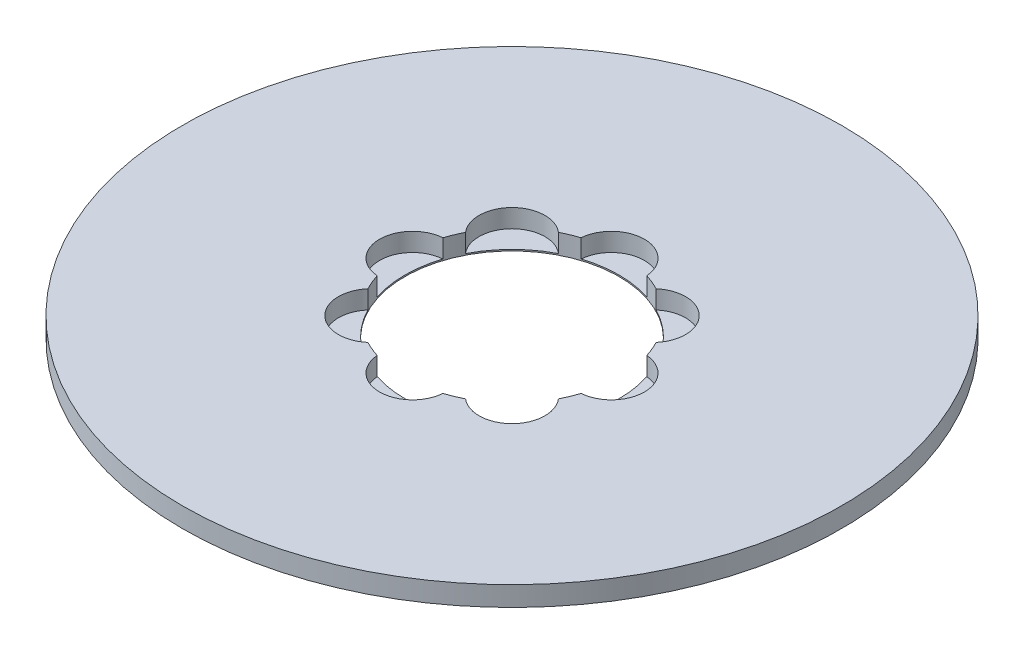
ISO-10303-21;
HEADER;
FILE_DESCRIPTION(('STEP AP214'),'2;1');
FILE_NAME('part.step','',(''),(''),'','','');
FILE_SCHEMA(('AUTOMOTIVE_DESIGN { 1 0 10303 214 1 1 1 1 }'));
ENDSEC;
DATA;
#1=APPLICATION_CONTEXT('core data for automotive mechanical design processes');
#2=APPLICATION_PROTOCOL_DEFINITION('international standard','automotive_design',2000,#1);
#3=PRODUCT_CONTEXT('',#1,'mechanical');
#4=PRODUCT('Part','Part','',(#3));
#5=PRODUCT_RELATED_PRODUCT_CATEGORY('part','',(#4));
#6=PRODUCT_DEFINITION_FORMATION('','',#4);
#7=PRODUCT_DEFINITION_CONTEXT('part definition',#1,'design');
#8=PRODUCT_DEFINITION('design','',#6,#7);
#9=PRODUCT_DEFINITION_SHAPE('','',#8);
#10=(LENGTH_UNIT() NAMED_UNIT(*) SI_UNIT(.MILLI.,.METRE.));
#11=(NAMED_UNIT(*) PLANE_ANGLE_UNIT() SI_UNIT($,.RADIAN.));
#12=(NAMED_UNIT(*) SI_UNIT($,.STERADIAN.) SOLID_ANGLE_UNIT());
#13=UNCERTAINTY_MEASURE_WITH_UNIT(LENGTH_MEASURE(1.E-05),#10,'distance_accuracy_value','');
#14=(GEOMETRIC_REPRESENTATION_CONTEXT(3) GLOBAL_UNCERTAINTY_ASSIGNED_CONTEXT((#13)) GLOBAL_UNIT_ASSIGNED_CONTEXT((#10,
#11,#12)) REPRESENTATION_CONTEXT('',''));
#15=CARTESIAN_POINT('',(0.,0.,0.));
#16=DIRECTION('',(0.,0.,1.));
#17=DIRECTION('',(1.,0.,0.));
#18=AXIS2_PLACEMENT_3D('',#15,#16,#17);
#19=CARTESIAN_POINT('',(0.,6.,0.));
#20=DIRECTION('',(0.,-1.,0.));
#21=DIRECTION('',(0.,0.,-1.));
#22=AXIS2_PLACEMENT_3D('',#19,#20,#21);
#23=CYLINDRICAL_SURFACE('',#22,100.);
#24=CARTESIAN_POINT('',(0.,6.,0.));
#25=DIRECTION('',(0.,1.,0.));
#26=DIRECTION('',(0.,0.,1.));
#27=AXIS2_PLACEMENT_3D('',#24,#25,#26);
#28=CIRCLE('',#27,100.);
#29=CARTESIAN_POINT('',(0.,6.,100.));
#30=VERTEX_POINT('',#29);
#31=EDGE_CURVE('E183',#30,#30,#28,.T.);
#32=ORIENTED_EDGE('',*,*,#31,.F.);
#33=EDGE_LOOP('',(#32));
#34=FACE_BOUND('',#33,.T.);
#35=CARTESIAN_POINT('',(0.,0.,0.));
#36=DIRECTION('',(0.,1.,0.));
#37=DIRECTION('',(0.,0.,1.));
#38=AXIS2_PLACEMENT_3D('',#35,#36,#37);
#39=CIRCLE('',#38,100.);
#40=CARTESIAN_POINT('',(0.,0.,100.));
#41=VERTEX_POINT('',#40);
#42=EDGE_CURVE('E182',#41,#41,#39,.T.);
#43=ORIENTED_EDGE('',*,*,#42,.T.);
#44=EDGE_LOOP('',(#43));
#45=FACE_BOUND('',#44,.T.);
#46=ADVANCED_FACE('F39',(#34,#45),#23,.T.);
#47=CARTESIAN_POINT('',(0.,6.,0.));
#48=DIRECTION('',(0.,1.,0.));
#49=DIRECTION('',(0.,0.,1.));
#50=AXIS2_PLACEMENT_3D('',#47,#48,#49);
#51=PLANE('',#50);
#52=CARTESIAN_POINT('',(1.05336279165295E-13,6.,30.169509426677));
#53=DIRECTION('',(0.,1.,0.));
#54=DIRECTION('',(1.,0.,0.));
#55=AXIS2_PLACEMENT_3D('',#52,#53,#54);
#56=CIRCLE('',#55,10.);
#57=CARTESIAN_POINT('',(-9.97083380300948,6.,30.9327087930036));
#58=VERTEX_POINT('',#57);
#59=CARTESIAN_POINT('',(9.9708338030097,6.,30.9327087930036));
#60=VERTEX_POINT('',#59);
#61=EDGE_CURVE('E256',#58,#60,#56,.T.);
#62=ORIENTED_EDGE('',*,*,#61,.F.);
#63=CARTESIAN_POINT('',(0.,6.,0.));
#64=DIRECTION('',(0.,1.,0.));
#65=DIRECTION('',(0.,0.,1.));
#66=AXIS2_PLACEMENT_3D('',#63,#64,#65);
#67=CIRCLE('',#66,32.5);
#68=CARTESIAN_POINT('',(-14.8222839518094,6.,28.9231723441937));
#69=VERTEX_POINT('',#68);
#70=EDGE_CURVE('E175',#69,#58,#67,.T.);
#71=ORIENTED_EDGE('',*,*,#70,.F.);
#72=CARTESIAN_POINT('',(-21.3330647006747,6.,21.3330647006748));
#73=DIRECTION('',(0.,1.,0.));
#74=DIRECTION('',(0.707106781186549,0.,0.707106781186546));
#75=AXIS2_PLACEMENT_3D('',#72,#73,#74);
#76=CIRCLE('',#75,10.);
#77=CARTESIAN_POINT('',(-28.9231723441937,6.,14.8222839518095));
#78=VERTEX_POINT('',#77);
#79=EDGE_CURVE('E152',#78,#69,#76,.T.);
#80=ORIENTED_EDGE('',*,*,#79,.F.);
#81=CARTESIAN_POINT('',(-30.9327087930036,6.,9.97083380300959));
#82=VERTEX_POINT('',#81);
#83=EDGE_CURVE('E168',#82,#78,#67,.T.);
#84=ORIENTED_EDGE('',*,*,#83,.F.);
#85=CARTESIAN_POINT('',(-30.169509426677,6.,0.));
#86=DIRECTION('',(0.,1.,0.));
#87=DIRECTION('',(0.,0.,1.));
#88=AXIS2_PLACEMENT_3D('',#85,#86,#87);
#89=CIRCLE('',#88,10.);
#90=CARTESIAN_POINT('',(-30.9327087930036,6.,-9.97083380300959));
#91=VERTEX_POINT('',#90);
#92=EDGE_CURVE('E205',#91,#82,#89,.T.);
#93=ORIENTED_EDGE('',*,*,#92,.F.);
#94=CARTESIAN_POINT('',(-28.9231723441939,6.,-14.8222839518091));
#95=VERTEX_POINT('',#94);
#96=EDGE_CURVE('E181',#95,#91,#67,.T.);
#97=ORIENTED_EDGE('',*,*,#96,.F.);
#98=CARTESIAN_POINT('',(-21.333064700675,6.,-21.3330647006745));
#99=DIRECTION('',(0.,1.,0.));
#100=DIRECTION('',(-0.707106781186539,0.,0.707106781186556));
#101=AXIS2_PLACEMENT_3D('',#98,#99,#100);
#102=CIRCLE('',#101,10.);
#103=CARTESIAN_POINT('',(-14.8222839518098,6.,-28.9231723441935));
#104=VERTEX_POINT('',#103);
#105=EDGE_CURVE('E453',#104,#95,#102,.T.);
#106=ORIENTED_EDGE('',*,*,#105,.F.);
#107=CARTESIAN_POINT('',(-9.97083380300991,6.,-30.9327087930035));
#108=VERTEX_POINT('',#107);
#109=EDGE_CURVE('E189',#108,#104,#67,.T.);
#110=ORIENTED_EDGE('',*,*,#109,.F.);
#111=CARTESIAN_POINT('',(-3.16008837495884E-13,6.,-30.169509426677));
#112=DIRECTION('',(0.,1.,0.));
#113=DIRECTION('',(-1.,0.,0.));
#114=AXIS2_PLACEMENT_3D('',#111,#112,#113);
#115=CIRCLE('',#114,10.);
#116=CARTESIAN_POINT('',(9.97083380300927,6.,-30.9327087930037));
#117=VERTEX_POINT('',#116);
#118=EDGE_CURVE('E462',#117,#108,#115,.T.);
#119=ORIENTED_EDGE('',*,*,#118,.F.);
#120=CARTESIAN_POINT('',(14.8222839518092,6.,-28.9231723441938));
#121=VERTEX_POINT('',#120);
#122=EDGE_CURVE('E197',#121,#117,#67,.T.);
#123=ORIENTED_EDGE('',*,*,#122,.F.);
#124=CARTESIAN_POINT('',(21.3330647006746,6.,-21.3330647006749));
#125=DIRECTION('',(0.,1.,0.));
#126=DIRECTION('',(-0.707106781186554,0.,-0.707106781186541));
#127=AXIS2_PLACEMENT_3D('',#124,#125,#126);
#128=CIRCLE('',#127,10.);
#129=CARTESIAN_POINT('',(28.9231723441936,6.,-14.8222839518097));
#130=VERTEX_POINT('',#129);
#131=EDGE_CURVE('E470',#130,#121,#128,.T.);
#132=ORIENTED_EDGE('',*,*,#131,.F.);
#133=CARTESIAN_POINT('',(30.9327087930036,6.,-9.97083380300959));
#134=VERTEX_POINT('',#133);
#135=EDGE_CURVE('E489',#134,#130,#67,.T.);
#136=ORIENTED_EDGE('',*,*,#135,.F.);
#137=CARTESIAN_POINT('',(30.169509426677,6.,0.));
#138=DIRECTION('',(0.,1.,0.));
#139=DIRECTION('',(0.,0.,-1.));
#140=AXIS2_PLACEMENT_3D('',#137,#138,#139);
#141=CIRCLE('',#140,10.);
#142=CARTESIAN_POINT('',(30.9327087930036,6.,9.97083380300959));
#143=VERTEX_POINT('',#142);
#144=EDGE_CURVE('E476',#143,#134,#141,.T.);
#145=ORIENTED_EDGE('',*,*,#144,.F.);
#146=CARTESIAN_POINT('',(28.9231723441938,6.,14.8222839518093));
#147=VERTEX_POINT('',#146);
#148=EDGE_CURVE('E491',#147,#143,#67,.T.);
#149=ORIENTED_EDGE('',*,*,#148,.F.);
#150=CARTESIAN_POINT('',(21.3330647006749,6.,21.3330647006746));
#151=DIRECTION('',(0.,1.,0.));
#152=DIRECTION('',(0.707106781186544,0.,-0.707106781186551));
#153=AXIS2_PLACEMENT_3D('',#150,#151,#152);
#154=CIRCLE('',#153,10.);
#155=CARTESIAN_POINT('',(14.8222839518096,6.,28.9231723441936));
#156=VERTEX_POINT('',#155);
#157=EDGE_CURVE('E475',#156,#147,#154,.T.);
#158=ORIENTED_EDGE('',*,*,#157,.F.);
#159=EDGE_CURVE('E190',#60,#156,#67,.T.);
#160=ORIENTED_EDGE('',*,*,#159,.F.);
#161=EDGE_LOOP('',(#62,#71,#80,#84,#93,#97,#106,#110,#119,#123,#132,#136,#145,#149,#158,#160));
#162=FACE_BOUND('',#161,.T.);
#163=ORIENTED_EDGE('',*,*,#31,.T.);
#164=EDGE_LOOP('',(#163));
#165=FACE_BOUND('',#164,.T.);
#166=ADVANCED_FACE('F170',(#162,#165),#51,.T.);
#167=CARTESIAN_POINT('',(0.,0.,0.));
#168=DIRECTION('',(0.,1.,0.));
#169=DIRECTION('',(0.,0.,1.));
#170=AXIS2_PLACEMENT_3D('',#167,#168,#169);
#171=PLANE('',#170);
#172=CARTESIAN_POINT('',(0.,0.,0.));
#173=DIRECTION('',(0.,1.,0.));
#174=DIRECTION('',(0.,0.,1.));
#175=AXIS2_PLACEMENT_3D('',#172,#173,#174);
#176=CIRCLE('',#175,32.5);
#177=CARTESIAN_POINT('',(0.,0.,32.5));
#178=VERTEX_POINT('',#177);
#179=EDGE_CURVE('E191',#178,#178,#176,.T.);
#180=ORIENTED_EDGE('',*,*,#179,.T.);
#181=EDGE_LOOP('',(#180));
#182=FACE_BOUND('',#181,.T.);
#183=ORIENTED_EDGE('',*,*,#42,.F.);
#184=EDGE_LOOP('',(#183));
#185=FACE_BOUND('',#184,.T.);
#186=ADVANCED_FACE('F277',(#182,#185),#171,.F.);
#187=CARTESIAN_POINT('',(0.,6.,0.));
#188=DIRECTION('',(0.,-1.,0.));
#189=DIRECTION('',(0.,0.,-1.));
#190=AXIS2_PLACEMENT_3D('',#187,#188,#189);
#191=CYLINDRICAL_SURFACE('',#190,32.5);
#192=DIRECTION('',(0.,1.,0.));
#193=VECTOR('',#192,1.);
#194=CARTESIAN_POINT('',(-9.97083380300948,3.21015580010637,30.9327087930036));
#195=LINE('',#194,#193);
#196=CARTESIAN_POINT('',(-9.97083380300948,0.420311600212744,30.9327087930036));
#197=VERTEX_POINT('',#196);
#198=EDGE_CURVE('E11',#197,#58,#195,.T.);
#199=ORIENTED_EDGE('',*,*,#198,.F.);
#200=CARTESIAN_POINT('',(0.,0.420311600212744,0.));
#201=DIRECTION('',(0.,1.,0.));
#202=DIRECTION('',(0.,0.,1.));
#203=AXIS2_PLACEMENT_3D('',#200,#201,#202);
#204=CIRCLE('',#203,32.5);
#205=CARTESIAN_POINT('',(9.9708338030097,0.420311600212744,30.9327087930036));
#206=VERTEX_POINT('',#205);
#207=EDGE_CURVE('E251',#197,#206,#204,.T.);
#208=ORIENTED_EDGE('',*,*,#207,.T.);
#209=DIRECTION('',(0.,1.,0.));
#210=VECTOR('',#209,1.);
#211=CARTESIAN_POINT('',(9.9708338030097,3.21015580010637,30.9327087930035));
#212=LINE('',#211,#210);
#213=EDGE_CURVE('E46',#60,#206,#212,.F.);
#214=ORIENTED_EDGE('',*,*,#213,.F.);
#215=ORIENTED_EDGE('',*,*,#159,.T.);
#216=DIRECTION('',(0.,1.,0.));
#217=VECTOR('',#216,1.);
#218=CARTESIAN_POINT('',(14.8222839518096,3.21015580010637,28.9231723441936));
#219=LINE('',#218,#217);
#220=CARTESIAN_POINT('',(14.8222839518096,0.420311600212744,28.9231723441936));
#221=VERTEX_POINT('',#220);
#222=EDGE_CURVE('E253',#221,#156,#219,.T.);
#223=ORIENTED_EDGE('',*,*,#222,.F.);
#224=CARTESIAN_POINT('',(0.,0.420311600212744,0.));
#225=DIRECTION('',(0.,1.,0.));
#226=DIRECTION('',(0.,0.,1.));
#227=AXIS2_PLACEMENT_3D('',#224,#225,#226);
#228=CIRCLE('',#227,32.5);
#229=CARTESIAN_POINT('',(28.9231723441938,0.420311600212744,14.8222839518093));
#230=VERTEX_POINT('',#229);
#231=EDGE_CURVE('E246',#221,#230,#228,.T.);
#232=ORIENTED_EDGE('',*,*,#231,.T.);
#233=DIRECTION('',(0.,1.,0.));
#234=VECTOR('',#233,1.);
#235=CARTESIAN_POINT('',(28.9231723441938,3.21015580010637,14.8222839518093));
#236=LINE('',#235,#234);
#237=EDGE_CURVE('E248',#147,#230,#236,.F.);
#238=ORIENTED_EDGE('',*,*,#237,.F.);
#239=ORIENTED_EDGE('',*,*,#148,.T.);
#240=DIRECTION('',(0.,1.,0.));
#241=VECTOR('',#240,1.);
#242=CARTESIAN_POINT('',(30.9327087930036,3.21015580010637,9.97083380300959));
#243=LINE('',#242,#241);
#244=CARTESIAN_POINT('',(30.9327087930036,0.420311600212744,9.97083380300959));
#245=VERTEX_POINT('',#244);
#246=EDGE_CURVE('E243',#245,#143,#243,.T.);
#247=ORIENTED_EDGE('',*,*,#246,.F.);
#248=CARTESIAN_POINT('',(0.,0.420311600212744,0.));
#249=DIRECTION('',(0.,1.,0.));
#250=DIRECTION('',(0.,0.,1.));
#251=AXIS2_PLACEMENT_3D('',#248,#249,#250);
#252=CIRCLE('',#251,32.5);
#253=CARTESIAN_POINT('',(30.9327087930036,0.420311600212744,-9.97083380300959));
#254=VERTEX_POINT('',#253);
#255=EDGE_CURVE('E236',#245,#254,#252,.T.);
#256=ORIENTED_EDGE('',*,*,#255,.T.);
#257=DIRECTION('',(0.,1.,0.));
#258=VECTOR('',#257,1.);
#259=CARTESIAN_POINT('',(30.9327087930036,3.21015580010637,-9.97083380300959));
#260=LINE('',#259,#258);
#261=EDGE_CURVE('E241',#134,#254,#260,.F.);
#262=ORIENTED_EDGE('',*,*,#261,.F.);
#263=ORIENTED_EDGE('',*,*,#135,.T.);
#264=DIRECTION('',(0.,1.,0.));
#265=VECTOR('',#264,1.);
#266=CARTESIAN_POINT('',(28.9231723441936,3.21015580010637,-14.8222839518097));
#267=LINE('',#266,#265);
#268=CARTESIAN_POINT('',(28.9231723441936,0.420311600212744,-14.8222839518097));
#269=VERTEX_POINT('',#268);
#270=EDGE_CURVE('E237',#269,#130,#267,.T.);
#271=ORIENTED_EDGE('',*,*,#270,.F.);
#272=CARTESIAN_POINT('',(0.,0.420311600212744,0.));
#273=DIRECTION('',(0.,1.,0.));
#274=DIRECTION('',(0.,0.,1.));
#275=AXIS2_PLACEMENT_3D('',#272,#273,#274);
#276=CIRCLE('',#275,32.5);
#277=CARTESIAN_POINT('',(14.8222839518092,0.420311600212744,-28.9231723441938));
#278=VERTEX_POINT('',#277);
#279=EDGE_CURVE('E229',#269,#278,#276,.T.);
#280=ORIENTED_EDGE('',*,*,#279,.T.);
#281=DIRECTION('',(0.,1.,0.));
#282=VECTOR('',#281,1.);
#283=CARTESIAN_POINT('',(14.8222839518092,3.21015580010637,-28.9231723441938));
#284=LINE('',#283,#282);
#285=EDGE_CURVE('E232',#121,#278,#284,.F.);
#286=ORIENTED_EDGE('',*,*,#285,.F.);
#287=ORIENTED_EDGE('',*,*,#122,.T.);
#288=DIRECTION('',(0.,1.,0.));
#289=VECTOR('',#288,1.);
#290=CARTESIAN_POINT('',(9.97083380300927,3.21015580010637,-30.9327087930037));
#291=LINE('',#290,#289);
#292=CARTESIAN_POINT('',(9.97083380300927,0.420311600212744,-30.9327087930037));
#293=VERTEX_POINT('',#292);
#294=EDGE_CURVE('E227',#293,#117,#291,.T.);
#295=ORIENTED_EDGE('',*,*,#294,.F.);
#296=CARTESIAN_POINT('',(0.,0.420311600212744,0.));
#297=DIRECTION('',(0.,1.,0.));
#298=DIRECTION('',(0.,0.,1.));
#299=AXIS2_PLACEMENT_3D('',#296,#297,#298);
#300=CIRCLE('',#299,32.5);
#301=CARTESIAN_POINT('',(-9.97083380300991,0.420311600212744,-30.9327087930035));
#302=VERTEX_POINT('',#301);
#303=EDGE_CURVE('E225',#293,#302,#300,.T.);
#304=ORIENTED_EDGE('',*,*,#303,.T.);
#305=DIRECTION('',(0.,1.,0.));
#306=VECTOR('',#305,1.);
#307=CARTESIAN_POINT('',(-9.97083380300991,3.21015580010637,-30.9327087930035));
#308=LINE('',#307,#306);
#309=EDGE_CURVE('E223',#108,#302,#308,.F.);
#310=ORIENTED_EDGE('',*,*,#309,.F.);
#311=ORIENTED_EDGE('',*,*,#109,.T.);
#312=DIRECTION('',(0.,1.,0.));
#313=VECTOR('',#312,1.);
#314=CARTESIAN_POINT('',(-14.8222839518098,3.21015580010637,-28.9231723441935));
#315=LINE('',#314,#313);
#316=CARTESIAN_POINT('',(-14.8222839518098,0.420311600212744,-28.9231723441935));
#317=VERTEX_POINT('',#316);
#318=EDGE_CURVE('E219',#317,#104,#315,.T.);
#319=ORIENTED_EDGE('',*,*,#318,.F.);
#320=CARTESIAN_POINT('',(0.,0.420311600212744,0.));
#321=DIRECTION('',(0.,1.,0.));
#322=DIRECTION('',(0.,0.,1.));
#323=AXIS2_PLACEMENT_3D('',#320,#321,#322);
#324=CIRCLE('',#323,32.5);
#325=CARTESIAN_POINT('',(-28.9231723441939,0.420311600212744,-14.8222839518091));
#326=VERTEX_POINT('',#325);
#327=EDGE_CURVE('E159',#317,#326,#324,.T.);
#328=ORIENTED_EDGE('',*,*,#327,.T.);
#329=DIRECTION('',(0.,1.,0.));
#330=VECTOR('',#329,1.);
#331=CARTESIAN_POINT('',(-28.9231723441939,3.21015580010637,-14.8222839518091));
#332=LINE('',#331,#330);
#333=EDGE_CURVE('E220',#95,#326,#332,.F.);
#334=ORIENTED_EDGE('',*,*,#333,.F.);
#335=ORIENTED_EDGE('',*,*,#96,.T.);
#336=DIRECTION('',(0.,1.,0.));
#337=VECTOR('',#336,1.);
#338=CARTESIAN_POINT('',(-30.9327087930036,3.21015580010637,-9.97083380300959));
#339=LINE('',#338,#337);
#340=CARTESIAN_POINT('',(-30.9327087930036,0.420311600212744,-9.97083380300959));
#341=VERTEX_POINT('',#340);
#342=EDGE_CURVE('E209',#341,#91,#339,.T.);
#343=ORIENTED_EDGE('',*,*,#342,.F.);
#344=CARTESIAN_POINT('',(0.,0.420311600212744,0.));
#345=DIRECTION('',(0.,1.,0.));
#346=DIRECTION('',(0.,0.,1.));
#347=AXIS2_PLACEMENT_3D('',#344,#345,#346);
#348=CIRCLE('',#347,32.5);
#349=CARTESIAN_POINT('',(-30.9327087930036,0.420311600212744,9.97083380300959));
#350=VERTEX_POINT('',#349);
#351=EDGE_CURVE('E206',#341,#350,#348,.T.);
#352=ORIENTED_EDGE('',*,*,#351,.T.);
#353=DIRECTION('',(0.,1.,0.));
#354=VECTOR('',#353,1.);
#355=CARTESIAN_POINT('',(-30.9327087930036,3.21015580010637,9.97083380300959));
#356=LINE('',#355,#354);
#357=EDGE_CURVE('E179',#82,#350,#356,.F.);
#358=ORIENTED_EDGE('',*,*,#357,.F.);
#359=ORIENTED_EDGE('',*,*,#83,.T.);
#360=DIRECTION('',(0.,1.,0.));
#361=VECTOR('',#360,1.);
#362=CARTESIAN_POINT('',(-28.9231723441937,3.21015580010637,14.8222839518095));
#363=LINE('',#362,#361);
#364=CARTESIAN_POINT('',(-28.9231723441937,0.420311600212744,14.8222839518095));
#365=VERTEX_POINT('',#364);
#366=EDGE_CURVE('E147',#365,#78,#363,.T.);
#367=ORIENTED_EDGE('',*,*,#366,.F.);
#368=CARTESIAN_POINT('',(0.,0.420311600212744,0.));
#369=DIRECTION('',(0.,1.,0.));
#370=DIRECTION('',(0.,0.,1.));
#371=AXIS2_PLACEMENT_3D('',#368,#369,#370);
#372=CIRCLE('',#371,32.5);
#373=CARTESIAN_POINT('',(-14.8222839518094,0.420311600212744,28.9231723441937));
#374=VERTEX_POINT('',#373);
#375=EDGE_CURVE('E215',#365,#374,#372,.T.);
#376=ORIENTED_EDGE('',*,*,#375,.T.);
#377=DIRECTION('',(0.,1.,0.));
#378=VECTOR('',#377,1.);
#379=CARTESIAN_POINT('',(-14.8222839518094,3.21015580010637,28.9231723441937));
#380=LINE('',#379,#378);
#381=EDGE_CURVE('E161',#69,#374,#380,.F.);
#382=ORIENTED_EDGE('',*,*,#381,.F.);
#383=ORIENTED_EDGE('',*,*,#70,.T.);
#384=EDGE_LOOP('',(#199,#208,#214,#215,#223,#232,#238,#239,#247,#256,#262,#263,#271,#280,#286,
#287,#295,#304,#310,#311,#319,#328,#334,#335,#343,#352,#358,#359,#367,#376,#382,#383));
#385=FACE_BOUND('',#384,.T.);
#386=ORIENTED_EDGE('',*,*,#179,.F.);
#387=EDGE_LOOP('',(#386));
#388=FACE_BOUND('',#387,.T.);
#389=ADVANCED_FACE('F176',(#385,#388),#191,.F.);
#390=CARTESIAN_POINT('',(-30.169509426677,0.420311600212744,0.));
#391=DIRECTION('',(0.,1.,0.));
#392=DIRECTION('',(0.,0.,1.));
#393=AXIS2_PLACEMENT_3D('',#390,#391,#392);
#394=CYLINDRICAL_SURFACE('',#393,10.);
#395=ORIENTED_EDGE('',*,*,#342,.T.);
#396=ORIENTED_EDGE('',*,*,#92,.T.);
#397=ORIENTED_EDGE('',*,*,#357,.T.);
#398=CARTESIAN_POINT('',(-30.169509426677,0.420311600212744,0.));
#399=DIRECTION('',(0.,1.,0.));
#400=DIRECTION('',(0.,0.,1.));
#401=AXIS2_PLACEMENT_3D('',#398,#399,#400);
#402=CIRCLE('',#401,10.);
#403=EDGE_CURVE('E200',#341,#350,#402,.T.);
#404=ORIENTED_EDGE('',*,*,#403,.F.);
#405=EDGE_LOOP('',(#395,#396,#397,#404));
#406=FACE_BOUND('',#405,.T.);
#407=ADVANCED_FACE('F286',(#406),#394,.F.);
#408=CARTESIAN_POINT('',(-30.169509426677,0.420311600212744,0.));
#409=DIRECTION('',(0.,1.,0.));
#410=DIRECTION('',(0.,0.,1.));
#411=AXIS2_PLACEMENT_3D('',#408,#409,#410);
#412=PLANE('',#411);
#413=ORIENTED_EDGE('',*,*,#403,.T.);
#414=ORIENTED_EDGE('',*,*,#351,.F.);
#415=EDGE_LOOP('',(#413,#414));
#416=FACE_BOUND('',#415,.T.);
#417=ADVANCED_FACE('F289',(#416),#412,.T.);
#418=CARTESIAN_POINT('',(-21.3330647006747,0.420311600212744,21.3330647006748));
#419=DIRECTION('',(0.,1.,0.));
#420=DIRECTION('',(0.,0.,1.));
#421=AXIS2_PLACEMENT_3D('',#418,#419,#420);
#422=CYLINDRICAL_SURFACE('',#421,10.);
#423=ORIENTED_EDGE('',*,*,#366,.T.);
#424=ORIENTED_EDGE('',*,*,#79,.T.);
#425=ORIENTED_EDGE('',*,*,#381,.T.);
#426=CARTESIAN_POINT('',(-21.3330647006747,0.420311600212744,21.3330647006748));
#427=DIRECTION('',(0.,1.,0.));
#428=DIRECTION('',(0.707106781186549,0.,0.707106781186546));
#429=AXIS2_PLACEMENT_3D('',#426,#427,#428);
#430=CIRCLE('',#429,10.);
#431=EDGE_CURVE('E156',#365,#374,#430,.T.);
#432=ORIENTED_EDGE('',*,*,#431,.F.);
#433=EDGE_LOOP('',(#423,#424,#425,#432));
#434=FACE_BOUND('',#433,.T.);
#435=ADVANCED_FACE('F155',(#434),#422,.F.);
#436=CARTESIAN_POINT('',(-21.3330647006747,0.420311600212744,21.3330647006748));
#437=DIRECTION('',(0.,1.,0.));
#438=DIRECTION('',(0.707106781186549,0.,0.707106781186546));
#439=AXIS2_PLACEMENT_3D('',#436,#437,#438);
#440=PLANE('',#439);
#441=ORIENTED_EDGE('',*,*,#431,.T.);
#442=ORIENTED_EDGE('',*,*,#375,.F.);
#443=EDGE_LOOP('',(#441,#442));
#444=FACE_BOUND('',#443,.T.);
#445=ADVANCED_FACE('F300',(#444),#440,.T.);
#446=CARTESIAN_POINT('',(-21.333064700675,0.420311600212744,-21.3330647006745));
#447=DIRECTION('',(0.,1.,0.));
#448=DIRECTION('',(0.,0.,1.));
#449=AXIS2_PLACEMENT_3D('',#446,#447,#448);
#450=CYLINDRICAL_SURFACE('',#449,10.);
#451=ORIENTED_EDGE('',*,*,#318,.T.);
#452=ORIENTED_EDGE('',*,*,#105,.T.);
#453=ORIENTED_EDGE('',*,*,#333,.T.);
#454=CARTESIAN_POINT('',(-21.333064700675,0.420311600212744,-21.3330647006745));
#455=DIRECTION('',(0.,1.,0.));
#456=DIRECTION('',(-0.707106781186539,0.,0.707106781186556));
#457=AXIS2_PLACEMENT_3D('',#454,#455,#456);
#458=CIRCLE('',#457,10.);
#459=EDGE_CURVE('E454',#317,#326,#458,.T.);
#460=ORIENTED_EDGE('',*,*,#459,.F.);
#461=EDGE_LOOP('',(#451,#452,#453,#460));
#462=FACE_BOUND('',#461,.T.);
#463=ADVANCED_FACE('F299',(#462),#450,.F.);
#464=CARTESIAN_POINT('',(-21.333064700675,0.420311600212744,-21.3330647006745));
#465=DIRECTION('',(0.,1.,0.));
#466=DIRECTION('',(-0.707106781186539,0.,0.707106781186556));
#467=AXIS2_PLACEMENT_3D('',#464,#465,#466);
#468=PLANE('',#467);
#469=ORIENTED_EDGE('',*,*,#459,.T.);
#470=ORIENTED_EDGE('',*,*,#327,.F.);
#471=EDGE_LOOP('',(#469,#470));
#472=FACE_BOUND('',#471,.T.);
#473=ADVANCED_FACE('F379',(#472),#468,.T.);
#474=CARTESIAN_POINT('',(-3.16008837495884E-13,0.420311600212744,-30.169509426677));
#475=DIRECTION('',(0.,1.,0.));
#476=DIRECTION('',(0.,0.,1.));
#477=AXIS2_PLACEMENT_3D('',#474,#475,#476);
#478=CYLINDRICAL_SURFACE('',#477,10.);
#479=ORIENTED_EDGE('',*,*,#294,.T.);
#480=ORIENTED_EDGE('',*,*,#118,.T.);
#481=ORIENTED_EDGE('',*,*,#309,.T.);
#482=CARTESIAN_POINT('',(-3.16008837495884E-13,0.420311600212744,-30.169509426677));
#483=DIRECTION('',(0.,1.,0.));
#484=DIRECTION('',(-1.,0.,0.));
#485=AXIS2_PLACEMENT_3D('',#482,#483,#484);
#486=CIRCLE('',#485,10.);
#487=EDGE_CURVE('E465',#293,#302,#486,.T.);
#488=ORIENTED_EDGE('',*,*,#487,.F.);
#489=EDGE_LOOP('',(#479,#480,#481,#488));
#490=FACE_BOUND('',#489,.T.);
#491=ADVANCED_FACE('F371',(#490),#478,.F.);
#492=CARTESIAN_POINT('',(-3.16008837495884E-13,0.420311600212744,-30.169509426677));
#493=DIRECTION('',(0.,1.,0.));
#494=DIRECTION('',(-1.,0.,0.));
#495=AXIS2_PLACEMENT_3D('',#492,#493,#494);
#496=PLANE('',#495);
#497=ORIENTED_EDGE('',*,*,#487,.T.);
#498=ORIENTED_EDGE('',*,*,#303,.F.);
#499=EDGE_LOOP('',(#497,#498));
#500=FACE_BOUND('',#499,.T.);
#501=ADVANCED_FACE('F308',(#500),#496,.T.);
#502=CARTESIAN_POINT('',(21.3330647006746,0.420311600212744,-21.3330647006749));
#503=DIRECTION('',(0.,1.,0.));
#504=DIRECTION('',(0.,0.,1.));
#505=AXIS2_PLACEMENT_3D('',#502,#503,#504);
#506=CYLINDRICAL_SURFACE('',#505,10.);
#507=ORIENTED_EDGE('',*,*,#270,.T.);
#508=ORIENTED_EDGE('',*,*,#131,.T.);
#509=ORIENTED_EDGE('',*,*,#285,.T.);
#510=CARTESIAN_POINT('',(21.3330647006746,0.420311600212744,-21.3330647006749));
#511=DIRECTION('',(0.,1.,0.));
#512=DIRECTION('',(-0.707106781186554,0.,-0.707106781186541));
#513=AXIS2_PLACEMENT_3D('',#510,#511,#512);
#514=CIRCLE('',#513,10.);
#515=EDGE_CURVE('E477',#269,#278,#514,.T.);
#516=ORIENTED_EDGE('',*,*,#515,.F.);
#517=EDGE_LOOP('',(#507,#508,#509,#516));
#518=FACE_BOUND('',#517,.T.);
#519=ADVANCED_FACE('F305',(#518),#506,.F.);
#520=CARTESIAN_POINT('',(21.3330647006746,0.420311600212744,-21.3330647006749));
#521=DIRECTION('',(0.,1.,0.));
#522=DIRECTION('',(-0.707106781186554,0.,-0.707106781186541));
#523=AXIS2_PLACEMENT_3D('',#520,#521,#522);
#524=PLANE('',#523);
#525=ORIENTED_EDGE('',*,*,#515,.T.);
#526=ORIENTED_EDGE('',*,*,#279,.F.);
#527=EDGE_LOOP('',(#525,#526));
#528=FACE_BOUND('',#527,.T.);
#529=ADVANCED_FACE('F304',(#528),#524,.T.);
#530=CARTESIAN_POINT('',(30.169509426677,0.420311600212744,0.));
#531=DIRECTION('',(0.,1.,0.));
#532=DIRECTION('',(0.,0.,1.));
#533=AXIS2_PLACEMENT_3D('',#530,#531,#532);
#534=CYLINDRICAL_SURFACE('',#533,10.);
#535=ORIENTED_EDGE('',*,*,#246,.T.);
#536=ORIENTED_EDGE('',*,*,#144,.T.);
#537=ORIENTED_EDGE('',*,*,#261,.T.);
#538=CARTESIAN_POINT('',(30.169509426677,0.420311600212744,0.));
#539=DIRECTION('',(0.,1.,0.));
#540=DIRECTION('',(0.,0.,-1.));
#541=AXIS2_PLACEMENT_3D('',#538,#539,#540);
#542=CIRCLE('',#541,10.);
#543=EDGE_CURVE('E478',#245,#254,#542,.T.);
#544=ORIENTED_EDGE('',*,*,#543,.F.);
#545=EDGE_LOOP('',(#535,#536,#537,#544));
#546=FACE_BOUND('',#545,.T.);
#547=ADVANCED_FACE('F309',(#546),#534,.F.);
#548=CARTESIAN_POINT('',(30.169509426677,0.420311600212744,0.));
#549=DIRECTION('',(0.,1.,0.));
#550=DIRECTION('',(0.,0.,-1.));
#551=AXIS2_PLACEMENT_3D('',#548,#549,#550);
#552=PLANE('',#551);
#553=ORIENTED_EDGE('',*,*,#543,.T.);
#554=ORIENTED_EDGE('',*,*,#255,.F.);
#555=EDGE_LOOP('',(#553,#554));
#556=FACE_BOUND('',#555,.T.);
#557=ADVANCED_FACE('F314',(#556),#552,.T.);
#558=CARTESIAN_POINT('',(21.3330647006749,0.420311600212744,21.3330647006746));
#559=DIRECTION('',(0.,1.,0.));
#560=DIRECTION('',(0.,0.,1.));
#561=AXIS2_PLACEMENT_3D('',#558,#559,#560);
#562=CYLINDRICAL_SURFACE('',#561,10.);
#563=ORIENTED_EDGE('',*,*,#222,.T.);
#564=ORIENTED_EDGE('',*,*,#157,.T.);
#565=ORIENTED_EDGE('',*,*,#237,.T.);
#566=CARTESIAN_POINT('',(21.3330647006749,0.420311600212744,21.3330647006746));
#567=DIRECTION('',(0.,1.,0.));
#568=DIRECTION('',(0.707106781186544,0.,-0.707106781186551));
#569=AXIS2_PLACEMENT_3D('',#566,#567,#568);
#570=CIRCLE('',#569,10.);
#571=EDGE_CURVE('E56',#221,#230,#570,.T.);
#572=ORIENTED_EDGE('',*,*,#571,.F.);
#573=EDGE_LOOP('',(#563,#564,#565,#572));
#574=FACE_BOUND('',#573,.T.);
#575=ADVANCED_FACE('F318',(#574),#562,.F.);
#576=CARTESIAN_POINT('',(21.3330647006749,0.420311600212744,21.3330647006746));
#577=DIRECTION('',(0.,1.,0.));
#578=DIRECTION('',(0.707106781186544,0.,-0.707106781186551));
#579=AXIS2_PLACEMENT_3D('',#576,#577,#578);
#580=PLANE('',#579);
#581=ORIENTED_EDGE('',*,*,#571,.T.);
#582=ORIENTED_EDGE('',*,*,#231,.F.);
#583=EDGE_LOOP('',(#581,#582));
#584=FACE_BOUND('',#583,.T.);
#585=ADVANCED_FACE('F270',(#584),#580,.T.);
#586=CARTESIAN_POINT('',(1.05336279165295E-13,0.420311600212744,30.169509426677));
#587=DIRECTION('',(0.,1.,0.));
#588=DIRECTION('',(0.,0.,1.));
#589=AXIS2_PLACEMENT_3D('',#586,#587,#588);
#590=CYLINDRICAL_SURFACE('',#589,10.);
#591=ORIENTED_EDGE('',*,*,#198,.T.);
#592=ORIENTED_EDGE('',*,*,#61,.T.);
#593=ORIENTED_EDGE('',*,*,#213,.T.);
#594=CARTESIAN_POINT('',(1.05336279165295E-13,0.420311600212744,30.169509426677));
#595=DIRECTION('',(0.,1.,0.));
#596=DIRECTION('',(1.,0.,0.));
#597=AXIS2_PLACEMENT_3D('',#594,#595,#596);
#598=CIRCLE('',#597,10.);
#599=EDGE_CURVE('E55',#197,#206,#598,.T.);
#600=ORIENTED_EDGE('',*,*,#599,.F.);
#601=EDGE_LOOP('',(#591,#592,#593,#600));
#602=FACE_BOUND('',#601,.T.);
#603=ADVANCED_FACE('F260',(#602),#590,.F.);
#604=CARTESIAN_POINT('',(1.05336279165295E-13,0.420311600212744,30.169509426677));
#605=DIRECTION('',(0.,1.,0.));
#606=DIRECTION('',(1.,0.,0.));
#607=AXIS2_PLACEMENT_3D('',#604,#605,#606);
#608=PLANE('',#607);
#609=ORIENTED_EDGE('',*,*,#599,.T.);
#610=ORIENTED_EDGE('',*,*,#207,.F.);
#611=EDGE_LOOP('',(#609,#610));
#612=FACE_BOUND('',#611,.T.);
#613=ADVANCED_FACE('F261',(#612),#608,.T.);
#614=CLOSED_SHELL('',(#46,#166,#186,#389,#407,#417,#435,#445,#463,#473,#491,#501,#519,#529,#547,
#557,#575,#585,#603,#613));
#615=MANIFOLD_SOLID_BREP('B2',#614);
#616=ADVANCED_BREP_SHAPE_REPRESENTATION('',(#18,#615),#14);
#617=SHAPE_DEFINITION_REPRESENTATION(#9,#616);
ENDSEC;
END-ISO-10303-21;
